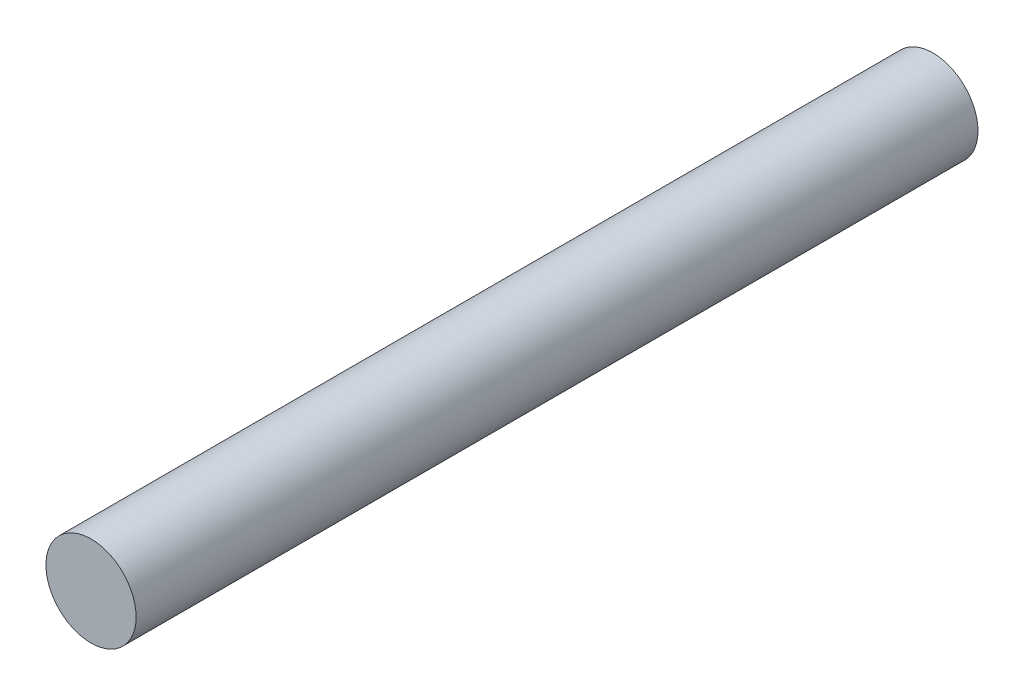
ISO-10303-21;
HEADER;
FILE_DESCRIPTION(('STEP AP214'),'2;1');
FILE_NAME('part.step','',(''),(''),'','','');
FILE_SCHEMA(('AUTOMOTIVE_DESIGN { 1 0 10303 214 1 1 1 1 }'));
ENDSEC;
DATA;
#1=APPLICATION_CONTEXT('core data for automotive mechanical design processes');
#2=APPLICATION_PROTOCOL_DEFINITION('international standard','automotive_design',2000,#1);
#3=PRODUCT_CONTEXT('',#1,'mechanical');
#4=PRODUCT('Part','Part','',(#3));
#5=PRODUCT_RELATED_PRODUCT_CATEGORY('part','',(#4));
#6=PRODUCT_DEFINITION_FORMATION('','',#4);
#7=PRODUCT_DEFINITION_CONTEXT('part definition',#1,'design');
#8=PRODUCT_DEFINITION('design','',#6,#7);
#9=PRODUCT_DEFINITION_SHAPE('','',#8);
#10=(LENGTH_UNIT() NAMED_UNIT(*) SI_UNIT(.MILLI.,.METRE.));
#11=(NAMED_UNIT(*) PLANE_ANGLE_UNIT() SI_UNIT($,.RADIAN.));
#12=(NAMED_UNIT(*) SI_UNIT($,.STERADIAN.) SOLID_ANGLE_UNIT());
#13=UNCERTAINTY_MEASURE_WITH_UNIT(LENGTH_MEASURE(1.E-05),#10,'distance_accuracy_value','');
#14=(GEOMETRIC_REPRESENTATION_CONTEXT(3) GLOBAL_UNCERTAINTY_ASSIGNED_CONTEXT((#13)) GLOBAL_UNIT_ASSIGNED_CONTEXT((#10,
#11,#12)) REPRESENTATION_CONTEXT('',''));
#15=CARTESIAN_POINT('',(0.,0.,0.));
#16=DIRECTION('',(0.,0.,1.));
#17=DIRECTION('',(1.,0.,0.));
#18=AXIS2_PLACEMENT_3D('',#15,#16,#17);
#19=CARTESIAN_POINT('',(0.,0.,7.));
#20=DIRECTION('',(0.,0.,-1.));
#21=DIRECTION('',(-1.,0.,0.));
#22=AXIS2_PLACEMENT_3D('',#19,#20,#21);
#23=CYLINDRICAL_SURFACE('',#22,0.75);
#24=CARTESIAN_POINT('',(0.,0.,7.));
#25=DIRECTION('',(0.,0.,1.));
#26=DIRECTION('',(1.,0.,0.));
#27=AXIS2_PLACEMENT_3D('',#24,#25,#26);
#28=CIRCLE('',#27,0.75);
#29=CARTESIAN_POINT('',(0.75,0.,7.));
#30=VERTEX_POINT('',#29);
#31=EDGE_CURVE('E12',#30,#30,#28,.T.);
#32=ORIENTED_EDGE('',*,*,#31,.F.);
#33=EDGE_LOOP('',(#32));
#34=FACE_BOUND('',#33,.T.);
#35=CARTESIAN_POINT('',(0.,0.,-7.));
#36=DIRECTION('',(0.,0.,1.));
#37=DIRECTION('',(1.,0.,0.));
#38=AXIS2_PLACEMENT_3D('',#35,#36,#37);
#39=CIRCLE('',#38,0.75);
#40=CARTESIAN_POINT('',(0.75,0.,-7.));
#41=VERTEX_POINT('',#40);
#42=EDGE_CURVE('E50',#41,#41,#39,.T.);
#43=ORIENTED_EDGE('',*,*,#42,.T.);
#44=EDGE_LOOP('',(#43));
#45=FACE_BOUND('',#44,.T.);
#46=ADVANCED_FACE('F47',(#34,#45),#23,.T.);
#47=CARTESIAN_POINT('',(0.,0.,7.));
#48=DIRECTION('',(0.,0.,1.));
#49=DIRECTION('',(1.,0.,0.));
#50=AXIS2_PLACEMENT_3D('',#47,#48,#49);
#51=PLANE('',#50);
#52=ORIENTED_EDGE('',*,*,#31,.T.);
#53=EDGE_LOOP('',(#52));
#54=FACE_BOUND('',#53,.T.);
#55=ADVANCED_FACE('F64',(#54),#51,.T.);
#56=CARTESIAN_POINT('',(0.,0.,-7.));
#57=DIRECTION('',(0.,0.,1.));
#58=DIRECTION('',(1.,0.,0.));
#59=AXIS2_PLACEMENT_3D('',#56,#57,#58);
#60=PLANE('',#59);
#61=ORIENTED_EDGE('',*,*,#42,.F.);
#62=EDGE_LOOP('',(#61));
#63=FACE_BOUND('',#62,.T.);
#64=ADVANCED_FACE('F62',(#63),#60,.F.);
#65=CLOSED_SHELL('',(#46,#55,#64));
#66=MANIFOLD_SOLID_BREP('B2',#65);
#67=ADVANCED_BREP_SHAPE_REPRESENTATION('',(#18,#66),#14);
#68=SHAPE_DEFINITION_REPRESENTATION(#9,#67);
ENDSEC;
END-ISO-10303-21;
